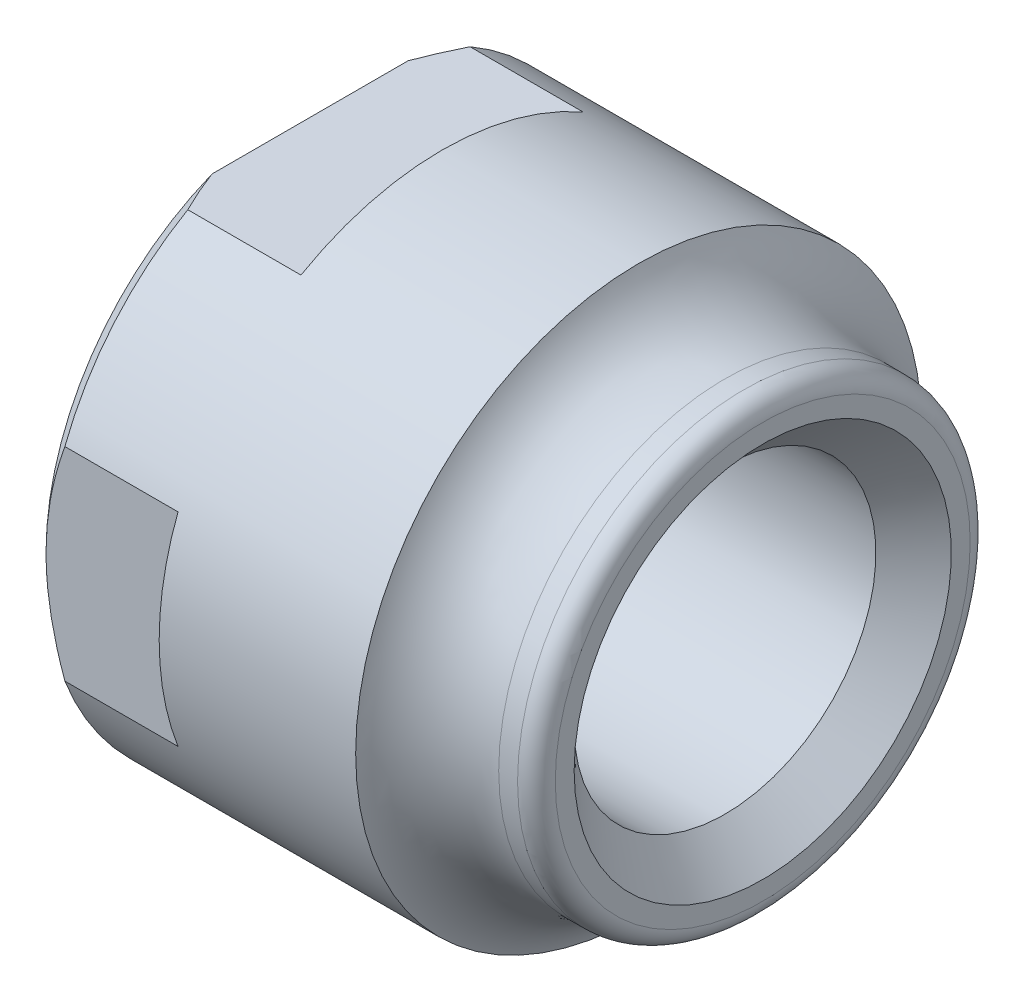
ISO-10303-21;
HEADER;
FILE_DESCRIPTION(('STEP AP214'),'2;1');
FILE_NAME('part.step','',(''),(''),'','','');
FILE_SCHEMA(('AUTOMOTIVE_DESIGN { 1 0 10303 214 1 1 1 1 }'));
ENDSEC;
DATA;
#1=APPLICATION_CONTEXT('core data for automotive mechanical design processes');
#2=APPLICATION_PROTOCOL_DEFINITION('international standard','automotive_design',2000,#1);
#3=PRODUCT_CONTEXT('',#1,'mechanical');
#4=PRODUCT('Part','Part','',(#3));
#5=PRODUCT_RELATED_PRODUCT_CATEGORY('part','',(#4));
#6=PRODUCT_DEFINITION_FORMATION('','',#4);
#7=PRODUCT_DEFINITION_CONTEXT('part definition',#1,'design');
#8=PRODUCT_DEFINITION('design','',#6,#7);
#9=PRODUCT_DEFINITION_SHAPE('','',#8);
#10=(LENGTH_UNIT() NAMED_UNIT(*) SI_UNIT(.MILLI.,.METRE.));
#11=(NAMED_UNIT(*) PLANE_ANGLE_UNIT() SI_UNIT($,.RADIAN.));
#12=(NAMED_UNIT(*) SI_UNIT($,.STERADIAN.) SOLID_ANGLE_UNIT());
#13=UNCERTAINTY_MEASURE_WITH_UNIT(LENGTH_MEASURE(1.E-05),#10,'distance_accuracy_value','');
#14=(GEOMETRIC_REPRESENTATION_CONTEXT(3) GLOBAL_UNCERTAINTY_ASSIGNED_CONTEXT((#13)) GLOBAL_UNIT_ASSIGNED_CONTEXT((#10,
#11,#12)) REPRESENTATION_CONTEXT('',''));
#15=CARTESIAN_POINT('',(0.,0.,0.));
#16=DIRECTION('',(0.,0.,1.));
#17=DIRECTION('',(1.,0.,0.));
#18=AXIS2_PLACEMENT_3D('',#15,#16,#17);
#19=CARTESIAN_POINT('',(-11.,7.50000000000003,2.22044604925031E-13));
#20=DIRECTION('',(1.,0.,0.));
#21=DIRECTION('',(0.,0.,-1.));
#22=AXIS2_PLACEMENT_3D('',#19,#20,#21);
#23=PLANE('',#22);
#24=CARTESIAN_POINT('',(-11.,0.,0.));
#25=DIRECTION('',(1.,0.,0.));
#26=DIRECTION('',(0.,0.,-1.));
#27=AXIS2_PLACEMENT_3D('',#24,#25,#26);
#28=CIRCLE('',#27,4.99999999999999);
#29=CARTESIAN_POINT('',(-11.,0.,-5.00000000000001));
#30=VERTEX_POINT('',#29);
#31=EDGE_CURVE('E144',#30,#30,#28,.T.);
#32=ORIENTED_EDGE('',*,*,#31,.T.);
#33=EDGE_LOOP('',(#32));
#34=FACE_BOUND('',#33,.T.);
#35=DIRECTION('',(0.,0.,-1.));
#36=VECTOR('',#35,1.);
#37=CARTESIAN_POINT('',(-11.,6.50000000000003,-7.00000000000001));
#38=LINE('',#37,#36);
#39=CARTESIAN_POINT('',(-11.,6.50000000000003,2.59807621135333));
#40=VERTEX_POINT('',#39);
#41=CARTESIAN_POINT('',(-11.,6.50000000000003,-2.59807621135333));
#42=VERTEX_POINT('',#41);
#43=EDGE_CURVE('E119',#40,#42,#38,.T.);
#44=ORIENTED_EDGE('',*,*,#43,.T.);
#45=CARTESIAN_POINT('',(-11.,0.,0.));
#46=DIRECTION('',(1.,0.,0.));
#47=DIRECTION('',(0.,0.,-1.));
#48=AXIS2_PLACEMENT_3D('',#45,#46,#47);
#49=CIRCLE('',#48,7.00000000000001);
#50=CARTESIAN_POINT('',(-11.,0.,-7.00000000000001));
#51=VERTEX_POINT('',#50);
#52=EDGE_CURVE('E133',#42,#51,#49,.F.);
#53=ORIENTED_EDGE('',*,*,#52,.T.);
#54=CARTESIAN_POINT('',(-11.,-6.50000000000001,-2.59807621135322));
#55=VERTEX_POINT('',#54);
#56=EDGE_CURVE('E125',#51,#55,#49,.F.);
#57=ORIENTED_EDGE('',*,*,#56,.T.);
#58=DIRECTION('',(0.,0.,1.));
#59=VECTOR('',#58,1.);
#60=CARTESIAN_POINT('',(-11.,-6.49999999999998,-6.9999999999999));
#61=LINE('',#60,#59);
#62=CARTESIAN_POINT('',(-11.,-6.49999999999998,2.59807621135344));
#63=VERTEX_POINT('',#62);
#64=EDGE_CURVE('E109',#55,#63,#61,.T.);
#65=ORIENTED_EDGE('',*,*,#64,.T.);
#66=CARTESIAN_POINT('',(-11.,0.,7.00000000000012));
#67=VERTEX_POINT('',#66);
#68=EDGE_CURVE('E134',#63,#67,#49,.F.);
#69=ORIENTED_EDGE('',*,*,#68,.T.);
#70=EDGE_CURVE('E139',#67,#40,#49,.F.);
#71=ORIENTED_EDGE('',*,*,#70,.T.);
#72=EDGE_LOOP('',(#44,#53,#57,#65,#69,#71));
#73=FACE_BOUND('',#72,.T.);
#74=ADVANCED_FACE('F27',(#34,#73),#23,.F.);
#75=CARTESIAN_POINT('',(-14.5399066753228,0.,0.));
#76=DIRECTION('',(-1.,0.,0.));
#77=DIRECTION('',(0.,0.,1.));
#78=AXIS2_PLACEMENT_3D('',#75,#76,#77);
#79=CYLINDRICAL_SURFACE('',#78,7.5);
#80=CARTESIAN_POINT('',(-2.29128784747794,0.,1.11022302462516E-13));
#81=DIRECTION('',(-1.,0.,0.));
#82=DIRECTION('',(0.,0.,1.));
#83=AXIS2_PLACEMENT_3D('',#80,#81,#82);
#84=CIRCLE('',#83,7.5);
#85=CARTESIAN_POINT('',(-2.29128784747795,0.,7.50000000000013));
#86=VERTEX_POINT('',#85);
#87=EDGE_CURVE('E165',#86,#86,#84,.T.);
#88=ORIENTED_EDGE('',*,*,#87,.T.);
#89=EDGE_LOOP('',(#88));
#90=FACE_BOUND('',#89,.T.);
#91=DIRECTION('',(-1.,0.,0.));
#92=VECTOR('',#91,1.);
#93=CARTESIAN_POINT('',(-14.5399066753228,-2.69258240356721,-6.99999999999978));
#94=LINE('',#93,#92);
#95=CARTESIAN_POINT('',(-7.50000000000001,-2.69258240356726,-6.9999999999999));
#96=VERTEX_POINT('',#95);
#97=CARTESIAN_POINT('',(-10.5,-2.69258240356721,-6.9999999999999));
#98=VERTEX_POINT('',#97);
#99=EDGE_CURVE('E42',#96,#98,#94,.T.);
#100=ORIENTED_EDGE('',*,*,#99,.F.);
#101=CARTESIAN_POINT('',(-7.5,0.,2.22044604925031E-13));
#102=DIRECTION('',(-1.,0.,0.));
#103=DIRECTION('',(0.,0.,1.));
#104=AXIS2_PLACEMENT_3D('',#101,#102,#103);
#105=CIRCLE('',#104,7.5);
#106=CARTESIAN_POINT('',(-7.50000000000002,2.69258240356732,-7.00000000000001));
#107=VERTEX_POINT('',#106);
#108=EDGE_CURVE('E12',#107,#96,#105,.T.);
#109=ORIENTED_EDGE('',*,*,#108,.F.);
#110=DIRECTION('',(-1.,0.,0.));
#111=VECTOR('',#110,1.);
#112=CARTESIAN_POINT('',(-14.5399066753228,2.69258240356735,-6.9999999999999));
#113=LINE('',#112,#111);
#114=CARTESIAN_POINT('',(-10.5,2.69258240356732,-6.9999999999999));
#115=VERTEX_POINT('',#114);
#116=EDGE_CURVE('E169',#115,#107,#113,.F.);
#117=ORIENTED_EDGE('',*,*,#116,.F.);
#118=CARTESIAN_POINT('',(-10.5,0.,0.));
#119=DIRECTION('',(1.,0.,0.));
#120=DIRECTION('',(0.,0.,-1.));
#121=AXIS2_PLACEMENT_3D('',#118,#119,#120);
#122=CIRCLE('',#121,7.5);
#123=CARTESIAN_POINT('',(-10.5,6.50000000000003,-3.7416573867739));
#124=VERTEX_POINT('',#123);
#125=EDGE_CURVE('E138',#115,#124,#122,.T.);
#126=ORIENTED_EDGE('',*,*,#125,.T.);
#127=DIRECTION('',(-1.,0.,0.));
#128=VECTOR('',#127,1.);
#129=CARTESIAN_POINT('',(-14.5399066753228,6.50000000000001,-3.7416573867739));
#130=LINE('',#129,#128);
#131=CARTESIAN_POINT('',(-7.5,6.49999999999998,-3.74165738677379));
#132=VERTEX_POINT('',#131);
#133=EDGE_CURVE('E173',#132,#124,#130,.T.);
#134=ORIENTED_EDGE('',*,*,#133,.F.);
#135=CARTESIAN_POINT('',(-7.49999999999999,6.50000000000003,3.74165738677412));
#136=VERTEX_POINT('',#135);
#137=EDGE_CURVE('E35',#136,#132,#105,.T.);
#138=ORIENTED_EDGE('',*,*,#137,.F.);
#139=DIRECTION('',(-1.,0.,0.));
#140=VECTOR('',#139,1.);
#141=CARTESIAN_POINT('',(-14.5399066753228,6.50000000000003,3.74165738677401));
#142=LINE('',#141,#140);
#143=CARTESIAN_POINT('',(-10.5,6.50000000000001,3.74165738677401));
#144=VERTEX_POINT('',#143);
#145=EDGE_CURVE('E171',#144,#136,#142,.F.);
#146=ORIENTED_EDGE('',*,*,#145,.F.);
#147=CARTESIAN_POINT('',(-10.5,2.69258240356729,7.00000000000012));
#148=VERTEX_POINT('',#147);
#149=EDGE_CURVE('E328',#144,#148,#122,.T.);
#150=ORIENTED_EDGE('',*,*,#149,.T.);
#151=DIRECTION('',(-1.,0.,0.));
#152=VECTOR('',#151,1.);
#153=CARTESIAN_POINT('',(-14.5399066753228,2.69258240356732,7.00000000000012));
#154=LINE('',#153,#152);
#155=CARTESIAN_POINT('',(-7.50000000000001,2.69258240356732,7.00000000000012));
#156=VERTEX_POINT('',#155);
#157=EDGE_CURVE('E175',#156,#148,#154,.T.);
#158=ORIENTED_EDGE('',*,*,#157,.F.);
#159=CARTESIAN_POINT('',(-7.50000000000001,-2.69258240356723,7.00000000000001));
#160=VERTEX_POINT('',#159);
#161=EDGE_CURVE('E205',#160,#156,#105,.T.);
#162=ORIENTED_EDGE('',*,*,#161,.F.);
#163=DIRECTION('',(-1.,0.,0.));
#164=VECTOR('',#163,1.);
#165=CARTESIAN_POINT('',(-14.5399066753228,-2.69258240356726,7.00000000000012));
#166=LINE('',#165,#164);
#167=CARTESIAN_POINT('',(-10.5,-2.69258240356718,7.00000000000023));
#168=VERTEX_POINT('',#167);
#169=EDGE_CURVE('E177',#168,#160,#166,.F.);
#170=ORIENTED_EDGE('',*,*,#169,.F.);
#171=CARTESIAN_POINT('',(-10.5,-6.49999999999998,3.74165738677401));
#172=VERTEX_POINT('',#171);
#173=EDGE_CURVE('E136',#168,#172,#122,.T.);
#174=ORIENTED_EDGE('',*,*,#173,.T.);
#175=DIRECTION('',(-1.,0.,0.));
#176=VECTOR('',#175,1.);
#177=CARTESIAN_POINT('',(-14.5399066753229,-6.49999999999998,3.74165738677401));
#178=LINE('',#177,#176);
#179=CARTESIAN_POINT('',(-7.5,-6.49999999999998,3.74165738677401));
#180=VERTEX_POINT('',#179);
#181=EDGE_CURVE('E50',#180,#172,#178,.T.);
#182=ORIENTED_EDGE('',*,*,#181,.F.);
#183=CARTESIAN_POINT('',(-7.50000000000001,-6.50000000000001,-3.7416573867739));
#184=VERTEX_POINT('',#183);
#185=EDGE_CURVE('E30',#184,#180,#105,.T.);
#186=ORIENTED_EDGE('',*,*,#185,.F.);
#187=DIRECTION('',(-1.,0.,0.));
#188=VECTOR('',#187,1.);
#189=CARTESIAN_POINT('',(-14.5399066753229,-6.50000000000003,-3.7416573867739));
#190=LINE('',#189,#188);
#191=CARTESIAN_POINT('',(-10.5,-6.50000000000001,-3.7416573867739));
#192=VERTEX_POINT('',#191);
#193=EDGE_CURVE('E179',#192,#184,#190,.F.);
#194=ORIENTED_EDGE('',*,*,#193,.F.);
#195=EDGE_CURVE('E127',#192,#98,#122,.T.);
#196=ORIENTED_EDGE('',*,*,#195,.T.);
#197=EDGE_LOOP('',(#100,#109,#117,#126,#134,#138,#146,#150,#158,#162,#170,#174,#182,#186,#194,#196));
#198=FACE_BOUND('',#197,.T.);
#199=ADVANCED_FACE('F225',(#90,#198),#79,.T.);
#200=CARTESIAN_POINT('',(-11.,0.,0.));
#201=DIRECTION('',(1.,0.,0.));
#202=DIRECTION('',(0.,0.,-1.));
#203=AXIS2_PLACEMENT_3D('',#200,#201,#202);
#204=CONICAL_SURFACE('',#203,7.00000000000001,0.785398163397446);
#205=ORIENTED_EDGE('',*,*,#125,.F.);
#206=CARTESIAN_POINT('',(-9.5104644485445,-4.80335444032884,-6.9999999999999));
#207=CARTESIAN_POINT('',(-9.58022515338993,-4.68004504980853,-6.9999999999999));
#208=CARTESIAN_POINT('',(-9.64861322057946,-4.55596064803132,-6.9999999999999));
#209=CARTESIAN_POINT('',(-9.78226547047349,-4.30608093200759,-6.99999999999989));
#210=CARTESIAN_POINT('',(-9.84752883188733,-4.18028517898935,-6.99999999999989));
#211=CARTESIAN_POINT('',(-10.0384838063702,-3.79924094490804,-6.9999999999999));
#212=CARTESIAN_POINT('',(-10.1588134092427,-3.54125422734984,-6.9999999999999));
#213=CARTESIAN_POINT('',(-10.3825977719299,-3.01374224965148,-6.99999999999989));
#214=CARTESIAN_POINT('',(-10.4857949771588,-2.74410650441234,-6.99999999999986));
#215=CARTESIAN_POINT('',(-10.6678390421334,-2.19700507433554,-6.99999999999993));
#216=CARTESIAN_POINT('',(-10.746725320138,-1.91955286919526,-7.00000000000004));
#217=CARTESIAN_POINT('',(-10.850441367433,-1.46457754744185,-6.99999999999999));
#218=CARTESIAN_POINT('',(-10.8844224944579,-1.28912543985645,-6.99999999999992));
#219=CARTESIAN_POINT('',(-10.9398198181762,-0.936207346127216,-6.99999999999987));
#220=CARTESIAN_POINT('',(-10.9612353977274,-0.758741261505516,-6.9999999999999));
#221=CARTESIAN_POINT('',(-10.9905551074238,-0.404096667901672,-6.9999999999999));
#222=CARTESIAN_POINT('',(-10.998564537527,-0.226926942885347,-6.99999999999987));
#223=CARTESIAN_POINT('',(-11.0010824764351,0.127509972435745,-6.99999999999992));
#224=CARTESIAN_POINT('',(-10.995590658195,0.304777164997509,-7.));
#225=CARTESIAN_POINT('',(-10.9695268399359,0.684462877124712,-7.00000000000001));
#226=CARTESIAN_POINT('',(-10.9468518626698,0.88673831168151,-6.99999999999993));
#227=CARTESIAN_POINT('',(-10.8851262310487,1.28877191693773,-6.99999999999986));
#228=CARTESIAN_POINT('',(-10.8460723373492,1.48852958163019,-6.99999999999989));
#229=CARTESIAN_POINT('',(-10.7527460172521,1.88697612508988,-6.9999999999999));
#230=CARTESIAN_POINT('',(-10.6982947566347,2.08562265617893,-6.9999999999999));
#231=CARTESIAN_POINT('',(-10.5764227790703,2.47879884943138,-6.99999999999989));
#232=CARTESIAN_POINT('',(-10.5090048887234,2.67332939859908,-6.99999999999989));
#233=CARTESIAN_POINT('',(-10.3372452106098,3.12668586830615,-6.9999999999999));
#234=CARTESIAN_POINT('',(-10.2283006193167,3.38376146297337,-6.9999999999999));
#235=CARTESIAN_POINT('',(-9.99458158904841,3.89067637520261,-6.9999999999999));
#236=CARTESIAN_POINT('',(-9.86979809852651,4.14051145390962,-6.9999999999999));
#237=CARTESIAN_POINT('',(-9.60746372366604,4.63450292809508,-6.9999999999999));
#238=CARTESIAN_POINT('',(-9.46986794296428,4.87863529464843,-6.9999999999999));
#239=CARTESIAN_POINT('',(-9.18503781364534,5.36110563570395,-6.9999999999999));
#240=CARTESIAN_POINT('',(-9.03780537601677,5.5994447462541,-6.9999999999999));
#241=CARTESIAN_POINT('',(-8.74307960122121,6.05972469805023,-6.9999999999999));
#242=CARTESIAN_POINT('',(-8.59594851191972,6.28189870394546,-6.9999999999999));
#243=CARTESIAN_POINT('',(-8.29610848968297,6.7224653956651,-6.9999999999999));
#244=CARTESIAN_POINT('',(-8.14339909620197,6.9408577670731,-6.9999999999999));
#245=CARTESIAN_POINT('',(-7.83481816974961,7.37248512718109,-6.9999999999999));
#246=CARTESIAN_POINT('',(-7.67898634048891,7.58574859999254,-6.9999999999999));
#247=CARTESIAN_POINT('',(-7.36366025352881,8.00946418977201,-6.9999999999999));
#248=CARTESIAN_POINT('',(-7.20416699623383,8.21991705039491,-6.9999999999999));
#249=CARTESIAN_POINT('',(-7.04319335098565,8.42921182222189,-6.9999999999999));
#250=B_SPLINE_CURVE_WITH_KNOTS('',3,(#206,#207,#208,#209,#210,#211,#212,#213,#214,#215,#216,
#217,#218,#219,#220,#221,#222,#223,#224,#225,#226,#227,#228,#229,#230,#231,#232,#233,#234,#235,
#236,#237,#238,#239,#240,#241,#242,#243,#244,#245,#246,#247,#248,#249),.UNSPECIFIED.,.F.,.F.,(4,
2,2,2,2,2,2,2,2,2,2,2,2,2,2,2,2,2,2,2,2,4),(0.,0.425007431194064,0.850125963945295,
1.70353641051276,2.56879851513163,3.43265019278093,3.96839432261139,4.50416476268646,
5.0357068438784,5.5672618009072,6.177147341071,6.78715355843523,7.404558282959,8.02182857144387,
8.85872603239434,9.69610393157133,10.5365352800348,11.3768004695187,12.1761244720147,
12.9755146166519,13.7678631511011,14.5599977115599),.UNSPECIFIED.);
#251=EDGE_CURVE('E202',#115,#51,#250,.F.);
#252=ORIENTED_EDGE('',*,*,#251,.T.);
#253=ORIENTED_EDGE('',*,*,#52,.F.);
#254=CARTESIAN_POINT('',(-2.09444456432686,6.50000000000003,14.5167728410026));
#255=CARTESIAN_POINT('',(-2.28888590049727,6.50000000000003,14.3037257352321));
#256=CARTESIAN_POINT('',(-2.4829416560533,6.50000000000003,14.0903267767934));
#257=CARTESIAN_POINT('',(-2.87016852338466,6.50000000000003,13.662724509046));
#258=CARTESIAN_POINT('',(-3.06333962746361,6.50000000000003,13.4485211927689));
#259=CARTESIAN_POINT('',(-3.6414456056037,6.50000000000003,12.8044535363723));
#260=CARTESIAN_POINT('',(-4.02487723192493,6.50000000000003,12.3732363582102));
#261=CARTESIAN_POINT('',(-4.78920557614493,6.50000000000003,11.5029881454459));
#262=CARTESIAN_POINT('',(-5.17006366086683,6.50000000000003,11.0639231068428));
#263=CARTESIAN_POINT('',(-5.92439287672877,6.50000000000003,10.1795722564133));
#264=CARTESIAN_POINT('',(-6.29786498617129,6.50000000000003,9.73428728195598));
#265=CARTESIAN_POINT('',(-6.97881092586992,6.50000000000003,8.90306628730305));
#266=CARTESIAN_POINT('',(-7.28773358351573,6.50000000000003,8.51832372562222));
#267=CARTESIAN_POINT('',(-7.74331145203938,6.50000000000003,7.93500490400866));
#268=CARTESIAN_POINT('',(-7.89389490284897,6.50000000000003,7.73949703673706));
#269=CARTESIAN_POINT('',(-8.19191036379332,6.50000000000003,7.34609714701157));
#270=CARTESIAN_POINT('',(-8.33934246050561,6.50000000000003,7.14820519029021));
#271=CARTESIAN_POINT('',(-8.63021281144892,6.50000000000003,6.74991794145694));
#272=CARTESIAN_POINT('',(-8.77365627312661,6.50000000000003,6.54952646102954));
#273=CARTESIAN_POINT('',(-9.05592097883785,6.50000000000003,6.14552229203602));
#274=CARTESIAN_POINT('',(-9.19474250100636,6.50000000000003,5.94190979839287));
#275=CARTESIAN_POINT('',(-9.46663604426284,6.50000000000003,5.53100587062468));
#276=CARTESIAN_POINT('',(-9.59971075746195,6.50000000000003,5.3237162247117));
#277=CARTESIAN_POINT('',(-9.85876830842536,6.50000000000003,4.90476923575897));
#278=CARTESIAN_POINT('',(-9.98475214542431,6.50000000000003,4.69311251389402));
#279=CARTESIAN_POINT('',(-10.2246432273407,6.50000000000003,4.27032520172268));
#280=CARTESIAN_POINT('',(-10.3387802170412,6.50000000000003,4.05932576652228));
#281=CARTESIAN_POINT('',(-10.5564451002365,6.50000000000003,3.63185218077574));
#282=CARTESIAN_POINT('',(-10.6599720014352,6.50000000000003,3.41537752052183));
#283=CARTESIAN_POINT('',(-10.8534861395401,6.50000000000004,2.97679700349965));
#284=CARTESIAN_POINT('',(-10.9434939642464,6.50000000000005,2.75470032370624));
#285=CARTESIAN_POINT('',(-11.1067900658467,6.50000000000002,2.30440786641476));
#286=CARTESIAN_POINT('',(-11.1800830172556,6.49999999999997,2.07621381411307));
#287=CARTESIAN_POINT('',(-11.2941903524043,6.49999999999998,1.65836655300459));
#288=CARTESIAN_POINT('',(-11.3385349200322,6.50000000000002,1.4696830764343));
#289=CARTESIAN_POINT('',(-11.4119868912289,6.50000000000005,1.08935429814918));
#290=CARTESIAN_POINT('',(-11.4410964663115,6.50000000000003,0.897709422547403));
#291=CARTESIAN_POINT('',(-11.4825837296564,6.50000000000003,0.513013752311657));
#292=CARTESIAN_POINT('',(-11.4949977529203,6.50000000000005,0.319966933061174));
#293=CARTESIAN_POINT('',(-11.5025309231229,6.50000000000002,-0.0664703249129604));
#294=CARTESIAN_POINT('',(-11.4976500313757,6.49999999999998,-0.259860764404268));
#295=CARTESIAN_POINT('',(-11.470889972009,6.49999999999998,-0.645097634224882));
#296=CARTESIAN_POINT('',(-11.4490410008602,6.50000000000002,-0.836946196330901));
#297=CARTESIAN_POINT('',(-11.3895216676062,6.50000000000005,-1.21815298294827));
#298=CARTESIAN_POINT('',(-11.3518499680599,6.50000000000004,-1.40751099554627));
#299=CARTESIAN_POINT('',(-11.2622785911483,6.50000000000003,-1.7833438476787));
#300=CARTESIAN_POINT('',(-11.210339788573,6.50000000000003,-1.96980924712377));
#301=CARTESIAN_POINT('',(-11.0942424687091,6.50000000000003,-2.3388410236065));
#302=CARTESIAN_POINT('',(-11.0300844407203,6.50000000000003,-2.52140755644276));
#303=CARTESIAN_POINT('',(-10.8690261617707,6.50000000000003,-2.9410108382494));
#304=CARTESIAN_POINT('',(-10.7682493912508,6.50000000000003,-3.17655321772081));
#305=CARTESIAN_POINT('',(-10.5525004168119,6.50000000000003,-3.64109932787145));
#306=CARTESIAN_POINT('',(-10.4375205941356,6.50000000000003,-3.87009946738187));
#307=CARTESIAN_POINT('',(-10.1962610693955,6.50000000000003,-4.32262084311943));
#308=CARTESIAN_POINT('',(-10.0699588542962,6.50000000000003,-4.54612998502487));
#309=CARTESIAN_POINT('',(-9.80867897099008,6.50000000000003,-4.98793097432684));
#310=CARTESIAN_POINT('',(-9.67370280738511,6.50000000000003,-5.20622371760723));
#311=CARTESIAN_POINT('',(-9.39535784528376,6.50000000000003,-5.64074407396269));
#312=CARTESIAN_POINT('',(-9.25191342549017,6.50000000000003,-5.85692301835826));
#313=CARTESIAN_POINT('',(-8.95940893705072,6.50000000000003,-6.28544298212879));
#314=CARTESIAN_POINT('',(-8.81034868769783,6.50000000000003,-6.49778387767654));
#315=CARTESIAN_POINT('',(-8.50787358663583,6.50000000000004,-6.91895264945622));
#316=CARTESIAN_POINT('',(-8.35446407450141,6.50000000000004,-7.12778437128633));
#317=CARTESIAN_POINT('',(-8.04394168422079,6.50000000000003,-7.54267904332927));
#318=CARTESIAN_POINT('',(-7.88682869336657,6.50000000000001,-7.74874190897707));
#319=CARTESIAN_POINT('',(-7.5036804823029,6.5,-8.24357014373984));
#320=CARTESIAN_POINT('',(-7.27611434653797,6.50000000000002,-8.53114916312642));
#321=CARTESIAN_POINT('',(-6.81623637378956,6.50000000000004,-9.10248622387731));
#322=CARTESIAN_POINT('',(-6.58392441249762,6.50000000000004,-9.38624416483142));
#323=CARTESIAN_POINT('',(-6.11542687449583,6.50000000000003,-9.95077293822639));
#324=CARTESIAN_POINT('',(-5.87923946257725,6.50000000000003,-10.2315422451968));
#325=CARTESIAN_POINT('',(-5.40383478536215,6.50000000000003,-10.7905037692497));
#326=CARTESIAN_POINT('',(-5.16461749590008,6.50000000000003,-11.0686959657472));
#327=CARTESIAN_POINT('',(-4.69194593627728,6.50000000000003,-11.6134401445373));
#328=CARTESIAN_POINT('',(-4.45857492231151,6.50000000000003,-11.8800644514341));
#329=CARTESIAN_POINT('',(-3.98991092076485,6.50000000000003,-12.4116199763626));
#330=CARTESIAN_POINT('',(-3.75461792189077,6.50000000000003,-12.6765511844296));
#331=CARTESIAN_POINT('',(-3.28262473724137,6.50000000000003,-13.2047415335476));
#332=CARTESIAN_POINT('',(-3.04592595363371,6.50000000000003,-13.4680019286517));
#333=CARTESIAN_POINT('',(-2.57115677585715,6.50000000000003,-13.9932737495572));
#334=CARTESIAN_POINT('',(-2.33308640935326,6.50000000000003,-14.2552852003565));
#335=CARTESIAN_POINT('',(-2.09444456432689,6.50000000000003,-14.5167728410026));
#336=B_SPLINE_CURVE_WITH_KNOTS('',3,(#254,#255,#256,#257,#258,#259,#260,#261,#262,#263,#264,
#265,#266,#267,#268,#269,#270,#271,#272,#273,#274,#275,#276,#277,#278,#279,#280,#281,#282,#283,
#284,#285,#286,#287,#288,#289,#290,#291,#292,#293,#294,#295,#296,#297,#298,#299,#300,#301,#302,
#303,#304,#305,#306,#307,#308,#309,#310,#311,#312,#313,#314,#315,#316,#317,#318,#319,#320,#321,
#322,#323,#324,#325,#326,#327,#328,#329,#330,#331,#332,#333,#334,#335),.UNSPECIFIED.,.F.,.F.,(4,
2,2,2,2,2,2,2,2,2,2,2,2,2,2,2,2,2,2,2,2,2,2,2,2,2,2,2,2,2,2,2,2,2,2,2,2,2,2,2,4),(0.,
0.86531322140501,1.73063395669946,3.46170176172355,5.20534138745016,6.9487484929174,
8.42884989750244,9.16915482780826,9.90943939342089,10.6487071709608,11.3879303807947,
12.1268034570576,12.8655721504997,13.5850095874066,14.3045142475676,15.0229118369983,
15.7411082708739,16.3220364036134,16.9028817114216,17.4824608524156,18.0620412898361,
18.6405926602068,19.2191929433914,19.7993960633781,20.3795759549178,21.1475304702325,
21.9158987329388,22.6858301950708,23.4556284618599,24.2338427048727,25.0120820108056,
25.7894040539476,26.566749783959,27.6668585824249,28.7669962333275,29.8676708141783,
30.9683541792715,32.0313367795752,33.0943256302527,34.1563897849169,35.2184325920844),.UNSPECIFIED.);
#337=EDGE_CURVE('E200',#42,#124,#336,.T.);
#338=ORIENTED_EDGE('',*,*,#337,.T.);
#339=EDGE_LOOP('',(#205,#252,#253,#338));
#340=FACE_BOUND('',#339,.T.);
#341=ADVANCED_FACE('F199',(#340),#204,.T.);
#342=ORIENTED_EDGE('',*,*,#56,.F.);
#343=EDGE_CURVE('E204',#51,#98,#250,.F.);
#344=ORIENTED_EDGE('',*,*,#343,.T.);
#345=ORIENTED_EDGE('',*,*,#195,.F.);
#346=CARTESIAN_POINT('',(-2.09444456432689,-6.50000000000001,-14.5167728410025));
#347=CARTESIAN_POINT('',(-2.28888590049732,-6.50000000000002,-14.303725735232));
#348=CARTESIAN_POINT('',(-2.48294165605336,-6.50000000000003,-14.0903267767933));
#349=CARTESIAN_POINT('',(-2.87016852338472,-6.50000000000004,-13.6627245090459));
#350=CARTESIAN_POINT('',(-3.06333962746367,-6.50000000000004,-13.4485211927688));
#351=CARTESIAN_POINT('',(-3.64144560560375,-6.50000000000003,-12.8044535363722));
#352=CARTESIAN_POINT('',(-4.02487723192498,-6.50000000000003,-12.3732363582101));
#353=CARTESIAN_POINT('',(-4.789205576145,-6.50000000000004,-11.5029881454458));
#354=CARTESIAN_POINT('',(-5.17006366086692,-6.50000000000005,-11.0639231068427));
#355=CARTESIAN_POINT('',(-5.92439287672882,-6.50000000000002,-10.1795722564131));
#356=CARTESIAN_POINT('',(-6.29786498617127,-6.49999999999997,-9.73428728195575));
#357=CARTESIAN_POINT('',(-6.97881092586991,-6.49999999999998,-8.90306628730284));
#358=CARTESIAN_POINT('',(-7.28773358351579,-6.50000000000002,-8.51832372562208));
#359=CARTESIAN_POINT('',(-7.74331145203944,-6.50000000000004,-7.93500490400855));
#360=CARTESIAN_POINT('',(-7.89389490284902,-6.50000000000003,-7.73949703673695));
#361=CARTESIAN_POINT('',(-8.19191036379336,-6.50000000000003,-7.34609714701146));
#362=CARTESIAN_POINT('',(-8.33934246050565,-6.50000000000003,-7.14820519029011));
#363=CARTESIAN_POINT('',(-8.63021281144895,-6.50000000000003,-6.74991794145685));
#364=CARTESIAN_POINT('',(-8.77365627312664,-6.50000000000003,-6.54952646102945));
#365=CARTESIAN_POINT('',(-9.05592097883786,-6.50000000000003,-6.14552229203594));
#366=CARTESIAN_POINT('',(-9.19474250100638,-6.50000000000003,-5.9419097983928));
#367=CARTESIAN_POINT('',(-9.46663604426283,-6.50000000000004,-5.53100587062461));
#368=CARTESIAN_POINT('',(-9.59971075746193,-6.50000000000004,-5.32371622471164));
#369=CARTESIAN_POINT('',(-9.85876830842536,-6.50000000000003,-4.90476923575893));
#370=CARTESIAN_POINT('',(-9.98475214542434,-6.50000000000001,-4.69311251389401));
#371=CARTESIAN_POINT('',(-10.2246432273407,-6.50000000000001,-4.27032520172265));
#372=CARTESIAN_POINT('',(-10.3387802170412,-6.50000000000003,-4.05932576652222));
#373=CARTESIAN_POINT('',(-10.5564451002365,-6.50000000000004,-3.63185218077562));
#374=CARTESIAN_POINT('',(-10.6599720014352,-6.50000000000004,-3.41537752052169));
#375=CARTESIAN_POINT('',(-10.8534861395402,-6.50000000000003,-2.97679700349946));
#376=CARTESIAN_POINT('',(-10.9434939642465,-6.50000000000003,-2.75470032370603));
#377=CARTESIAN_POINT('',(-11.1067900658467,-6.50000000000003,-2.30440786641449));
#378=CARTESIAN_POINT('',(-11.1800830172556,-6.50000000000003,-2.07621381411276));
#379=CARTESIAN_POINT('',(-11.2941903524043,-6.50000000000003,-1.65836655300428));
#380=CARTESIAN_POINT('',(-11.3385349200322,-6.50000000000003,-1.46968307643403));
#381=CARTESIAN_POINT('',(-11.4119868912289,-6.50000000000003,-1.08935429814896));
#382=CARTESIAN_POINT('',(-11.4410964663114,-6.50000000000003,-0.897709422547204));
#383=CARTESIAN_POINT('',(-11.4825837296563,-6.50000000000004,-0.513013752311511));
#384=CARTESIAN_POINT('',(-11.4949977529202,-6.50000000000005,-0.319966933061057));
#385=CARTESIAN_POINT('',(-11.5025309231229,-6.50000000000002,0.0664703249130207));
#386=CARTESIAN_POINT('',(-11.4976500313757,-6.49999999999998,0.2598607644043));
#387=CARTESIAN_POINT('',(-11.470889972009,-6.49999999999998,0.645097634224905));
#388=CARTESIAN_POINT('',(-11.4490410008601,-6.50000000000002,0.836946196330943));
#389=CARTESIAN_POINT('',(-11.3895216676061,-6.50000000000005,1.21815298294836));
#390=CARTESIAN_POINT('',(-11.3518499680598,-6.50000000000003,1.40751099554639));
#391=CARTESIAN_POINT('',(-11.2622785911482,-6.50000000000003,1.78334384767886));
#392=CARTESIAN_POINT('',(-11.2103397885729,-6.50000000000005,1.96980924712395));
#393=CARTESIAN_POINT('',(-11.094242468709,-6.50000000000002,2.33884102360675));
#394=CARTESIAN_POINT('',(-11.0300844407203,-6.49999999999998,2.52140755644306));
#395=CARTESIAN_POINT('',(-10.8690261617707,-6.49999999999997,2.94101083824972));
#396=CARTESIAN_POINT('',(-10.7682493912507,-6.50000000000002,3.17655321772106));
#397=CARTESIAN_POINT('',(-10.5525004168117,-6.50000000000005,3.64109932787163));
#398=CARTESIAN_POINT('',(-10.4375205941355,-6.50000000000004,3.87009946738205));
#399=CARTESIAN_POINT('',(-10.1962610693954,-6.50000000000003,4.32262084311961));
#400=CARTESIAN_POINT('',(-10.069958854296,-6.50000000000003,4.54612998502504));
#401=CARTESIAN_POINT('',(-9.80867897098994,-6.50000000000004,4.98793097432699));
#402=CARTESIAN_POINT('',(-9.67370280738497,-6.50000000000003,5.20622371760738));
#403=CARTESIAN_POINT('',(-9.39535784528363,-6.50000000000003,5.64074407396283));
#404=CARTESIAN_POINT('',(-9.25191342549004,-6.50000000000004,5.85692301835839));
#405=CARTESIAN_POINT('',(-8.95940893705059,-6.50000000000003,6.28544298212891));
#406=CARTESIAN_POINT('',(-8.81034868769772,-6.50000000000003,6.49778387767666));
#407=CARTESIAN_POINT('',(-8.50787358663572,-6.50000000000004,6.91895264945631));
#408=CARTESIAN_POINT('',(-8.35446407450129,-6.50000000000005,7.1277843712864));
#409=CARTESIAN_POINT('',(-8.04394168422071,-6.50000000000002,7.54267904332935));
#410=CARTESIAN_POINT('',(-7.88682869336655,-6.49999999999998,7.74874190897718));
#411=CARTESIAN_POINT('',(-7.50368048230291,-6.49999999999997,8.24357014373996));
#412=CARTESIAN_POINT('',(-7.27611434653791,-6.50000000000002,8.53114916312649));
#413=CARTESIAN_POINT('',(-6.81623637378946,-6.50000000000005,9.10248622387735));
#414=CARTESIAN_POINT('',(-6.58392441249754,-6.50000000000004,9.38624416483147));
#415=CARTESIAN_POINT('',(-6.11542687449575,-6.50000000000003,9.95077293822646));
#416=CARTESIAN_POINT('',(-5.87923946257717,-6.50000000000003,10.2315422451969));
#417=CARTESIAN_POINT('',(-5.40383478536207,-6.50000000000004,10.7905037692498));
#418=CARTESIAN_POINT('',(-5.16461749589999,-6.50000000000003,11.0686959657472));
#419=CARTESIAN_POINT('',(-4.69194593627719,-6.50000000000003,11.6134401445374));
#420=CARTESIAN_POINT('',(-4.45857492231142,-6.50000000000003,11.8800644514342));
#421=CARTESIAN_POINT('',(-3.98991092076476,-6.50000000000003,12.4116199763627));
#422=CARTESIAN_POINT('',(-3.75461792189068,-6.50000000000003,12.6765511844297));
#423=CARTESIAN_POINT('',(-3.28262473724128,-6.50000000000004,13.2047415335477));
#424=CARTESIAN_POINT('',(-3.04592595363362,-6.50000000000004,13.4680019286518));
#425=CARTESIAN_POINT('',(-2.57115677585707,-6.50000000000003,13.9932737495573));
#426=CARTESIAN_POINT('',(-2.3330864093532,-6.50000000000002,14.2552852003566));
#427=CARTESIAN_POINT('',(-2.09444456432686,-6.50000000000001,14.5167728410027));
#428=B_SPLINE_CURVE_WITH_KNOTS('',3,(#346,#347,#348,#349,#350,#351,#352,#353,#354,#355,#356,
#357,#358,#359,#360,#361,#362,#363,#364,#365,#366,#367,#368,#369,#370,#371,#372,#373,#374,#375,
#376,#377,#378,#379,#380,#381,#382,#383,#384,#385,#386,#387,#388,#389,#390,#391,#392,#393,#394,
#395,#396,#397,#398,#399,#400,#401,#402,#403,#404,#405,#406,#407,#408,#409,#410,#411,#412,#413,
#414,#415,#416,#417,#418,#419,#420,#421,#422,#423,#424,#425,#426,#427),.UNSPECIFIED.,.F.,.F.,(4,
2,2,2,2,2,2,2,2,2,2,2,2,2,2,2,2,2,2,2,2,2,2,2,2,2,2,2,2,2,2,2,2,2,2,2,2,2,2,2,4),(0.,
0.86531322140501,1.73063395669946,3.46170176172356,5.20534138745019,6.94874849291746,
8.42884989750246,9.16915482780827,9.90943939342088,10.6487071709608,11.3879303807946,
12.1268034570575,12.8655721504996,13.5850095874066,14.3045142475676,15.0229118369984,
15.7411082708741,16.3220364036136,16.9028817114216,17.4824608524155,18.062041289836,
18.6405926602068,19.2191929433914,19.7993960633782,20.379575954918,21.1475304702326,
21.9158987329388,22.6858301950708,23.4556284618599,24.2338427048728,25.0120820108056,
25.7894040539475,26.566749783959,27.6668585824248,28.7669962333274,29.8676708141782,
30.9683541792715,32.0313367795751,33.0943256302526,34.1563897849169,35.2184325920843),.UNSPECIFIED.);
#429=EDGE_CURVE('E112',#192,#55,#428,.T.);
#430=ORIENTED_EDGE('',*,*,#429,.T.);
#431=EDGE_LOOP('',(#342,#344,#345,#430));
#432=FACE_BOUND('',#431,.T.);
#433=ADVANCED_FACE('F124',(#432),#204,.T.);
#434=ORIENTED_EDGE('',*,*,#149,.F.);
#435=EDGE_CURVE('E206',#144,#40,#336,.T.);
#436=ORIENTED_EDGE('',*,*,#435,.T.);
#437=ORIENTED_EDGE('',*,*,#70,.F.);
#438=CARTESIAN_POINT('',(-9.51046444854452,-4.80335444032884,7.00000000000012));
#439=CARTESIAN_POINT('',(-9.58022515338989,-4.6800450498085,7.00000000000005));
#440=CARTESIAN_POINT('',(-9.64861322057939,-4.55596064803129,7.00000000000002));
#441=CARTESIAN_POINT('',(-9.7822654704734,-4.30608093200755,6.99999999999999));
#442=CARTESIAN_POINT('',(-9.84752883188724,-4.18028517898932,7.));
#443=CARTESIAN_POINT('',(-10.0384838063701,-3.79924094490801,7.00000000000002));
#444=CARTESIAN_POINT('',(-10.1588134092426,-3.54125422734979,7.00000000000002));
#445=CARTESIAN_POINT('',(-10.3825977719298,-3.01374224965142,6.99999999999999));
#446=CARTESIAN_POINT('',(-10.4857949771587,-2.74410650441227,6.99999999999997));
#447=CARTESIAN_POINT('',(-10.6678390421333,-2.19700507433549,7.00000000000004));
#448=CARTESIAN_POINT('',(-10.746725320138,-1.91955286919523,7.00000000000015));
#449=CARTESIAN_POINT('',(-10.850441367433,-1.46457754744182,7.0000000000001));
#450=CARTESIAN_POINT('',(-10.8844224944578,-1.28912543985642,7.00000000000003));
#451=CARTESIAN_POINT('',(-10.9398198181761,-0.936207346127183,6.99999999999998));
#452=CARTESIAN_POINT('',(-10.9612353977273,-0.758741261505489,7.00000000000001));
#453=CARTESIAN_POINT('',(-10.9905551074237,-0.404096667901653,7.00000000000001));
#454=CARTESIAN_POINT('',(-10.9985645375268,-0.22692694288533,6.99999999999998));
#455=CARTESIAN_POINT('',(-11.001082476435,0.127509972435756,7.00000000000003));
#456=CARTESIAN_POINT('',(-10.995590658195,0.304777164997517,7.00000000000011));
#457=CARTESIAN_POINT('',(-10.9695268399359,0.684462877124706,7.00000000000012));
#458=CARTESIAN_POINT('',(-10.9468518626697,0.886738311681491,7.00000000000004));
#459=CARTESIAN_POINT('',(-10.8851262310486,1.28877191693771,6.99999999999998));
#460=CARTESIAN_POINT('',(-10.8460723373491,1.48852958163016,7.));
#461=CARTESIAN_POINT('',(-10.752746017252,1.88697612508985,7.00000000000001));
#462=CARTESIAN_POINT('',(-10.6982947566346,2.0856226561789,6.99999999999998));
#463=CARTESIAN_POINT('',(-10.5764227790702,2.47879884943136,7.00000000000003));
#464=CARTESIAN_POINT('',(-10.5090048887234,2.67332939859908,7.0000000000001));
#465=CARTESIAN_POINT('',(-10.3372452106098,3.12668586830615,7.00000000000014));
#466=CARTESIAN_POINT('',(-10.2283006193167,3.38376146297333,7.00000000000004));
#467=CARTESIAN_POINT('',(-9.99458158904831,3.89067637520254,6.99999999999997));
#468=CARTESIAN_POINT('',(-9.86979809852644,4.14051145390956,7.));
#469=CARTESIAN_POINT('',(-9.60746372366599,4.63450292809503,7.00000000000002));
#470=CARTESIAN_POINT('',(-9.46986794296422,4.87863529464839,7.00000000000001));
#471=CARTESIAN_POINT('',(-9.18503781364527,5.36110563570391,7.));
#472=CARTESIAN_POINT('',(-9.03780537601671,5.59944474625406,7.00000000000001));
#473=CARTESIAN_POINT('',(-8.74307960122114,6.0597246980502,7.00000000000001));
#474=CARTESIAN_POINT('',(-8.59594851191965,6.28189870394544,7.00000000000001));
#475=CARTESIAN_POINT('',(-8.2961084896829,6.72246539566509,7.00000000000001));
#476=CARTESIAN_POINT('',(-8.1433990962019,6.94085776707309,7.00000000000001));
#477=CARTESIAN_POINT('',(-7.83481816974954,7.37248512718108,7.));
#478=CARTESIAN_POINT('',(-7.67898634048883,7.58574859999253,7.));
#479=CARTESIAN_POINT('',(-7.36366025352874,8.009464189772,7.00000000000002));
#480=CARTESIAN_POINT('',(-7.20416699623378,8.21991705039491,7.00000000000005));
#481=CARTESIAN_POINT('',(-7.04319335098565,8.42921182222192,7.00000000000012));
#482=B_SPLINE_CURVE_WITH_KNOTS('',3,(#438,#439,#440,#441,#442,#443,#444,#445,#446,#447,#448,
#449,#450,#451,#452,#453,#454,#455,#456,#457,#458,#459,#460,#461,#462,#463,#464,#465,#466,#467,
#468,#469,#470,#471,#472,#473,#474,#475,#476,#477,#478,#479,#480,#481),.UNSPECIFIED.,.F.,.F.,(4,
2,2,2,2,2,2,2,2,2,2,2,2,2,2,2,2,2,2,2,2,4),(0.,0.425007431194053,0.850125963945279,
1.70353641051276,2.56879851513164,3.43265019278093,3.96839432261137,4.50416476268643,
5.03570684387837,5.56726180090715,6.17714734107094,6.78715355843516,7.40455828295893,
8.02182857144379,8.85872603239424,9.69610393157122,10.5365352800348,11.3768004695187,
12.1761244720146,12.9755146166519,13.767863151101,14.5599977115598),.UNSPECIFIED.);
#483=EDGE_CURVE('E128',#67,#148,#482,.T.);
#484=ORIENTED_EDGE('',*,*,#483,.T.);
#485=EDGE_LOOP('',(#434,#436,#437,#484));
#486=FACE_BOUND('',#485,.T.);
#487=ADVANCED_FACE('F286',(#486),#204,.T.);
#488=ORIENTED_EDGE('',*,*,#173,.F.);
#489=EDGE_CURVE('E241',#168,#67,#482,.T.);
#490=ORIENTED_EDGE('',*,*,#489,.T.);
#491=ORIENTED_EDGE('',*,*,#68,.F.);
#492=EDGE_CURVE('E114',#63,#172,#428,.T.);
#493=ORIENTED_EDGE('',*,*,#492,.T.);
#494=EDGE_LOOP('',(#488,#490,#491,#493));
#495=FACE_BOUND('',#494,.T.);
#496=ADVANCED_FACE('F226',(#495),#204,.T.);
#497=CARTESIAN_POINT('',(-14.5399066753228,0.,0.));
#498=DIRECTION('',(-1.,0.,0.));
#499=DIRECTION('',(0.,0.,1.));
#500=AXIS2_PLACEMENT_3D('',#497,#498,#499);
#501=CYLINDRICAL_SURFACE('',#500,4.);
#502=CARTESIAN_POINT('',(-10.,0.,0.));
#503=DIRECTION('',(1.,0.,0.));
#504=DIRECTION('',(0.,0.,-1.));
#505=AXIS2_PLACEMENT_3D('',#502,#503,#504);
#506=CIRCLE('',#505,4.);
#507=CARTESIAN_POINT('',(-10.,0.,-4.00000000000001));
#508=VERTEX_POINT('',#507);
#509=EDGE_CURVE('E148',#508,#508,#506,.F.);
#510=ORIENTED_EDGE('',*,*,#509,.T.);
#511=EDGE_LOOP('',(#510));
#512=FACE_BOUND('',#511,.T.);
#513=CARTESIAN_POINT('',(0.,0.,0.));
#514=DIRECTION('',(-1.,0.,0.));
#515=DIRECTION('',(0.,0.,1.));
#516=AXIS2_PLACEMENT_3D('',#513,#514,#515);
#517=CIRCLE('',#516,4.);
#518=CARTESIAN_POINT('',(0.,0.,4.00000000000001));
#519=VERTEX_POINT('',#518);
#520=EDGE_CURVE('E153',#519,#519,#517,.F.);
#521=ORIENTED_EDGE('',*,*,#520,.T.);
#522=EDGE_LOOP('',(#521));
#523=FACE_BOUND('',#522,.T.);
#524=ADVANCED_FACE('F274',(#512,#523),#501,.F.);
#525=CARTESIAN_POINT('',(0.999999999999994,6.00000000000003,0.));
#526=DIRECTION('',(-1.,0.,0.));
#527=DIRECTION('',(0.,0.,1.));
#528=AXIS2_PLACEMENT_3D('',#525,#526,#527);
#529=PLANE('',#528);
#530=CARTESIAN_POINT('',(0.999999999999987,0.,0.));
#531=DIRECTION('',(-1.,0.,0.));
#532=DIRECTION('',(0.,0.,1.));
#533=AXIS2_PLACEMENT_3D('',#530,#531,#532);
#534=CIRCLE('',#533,5.);
#535=CARTESIAN_POINT('',(0.999999999999987,0.,5.00000000000001));
#536=VERTEX_POINT('',#535);
#537=EDGE_CURVE('E141',#536,#536,#534,.T.);
#538=ORIENTED_EDGE('',*,*,#537,.T.);
#539=EDGE_LOOP('',(#538));
#540=FACE_BOUND('',#539,.T.);
#541=CARTESIAN_POINT('',(0.999999999999987,0.,0.));
#542=DIRECTION('',(-1.,0.,0.));
#543=DIRECTION('',(0.,0.,1.));
#544=AXIS2_PLACEMENT_3D('',#541,#542,#543);
#545=CIRCLE('',#544,5.5);
#546=CARTESIAN_POINT('',(0.999999999999987,0.,5.50000000000001));
#547=VERTEX_POINT('',#546);
#548=EDGE_CURVE('E156',#547,#547,#545,.F.);
#549=ORIENTED_EDGE('',*,*,#548,.T.);
#550=EDGE_LOOP('',(#549));
#551=FACE_BOUND('',#550,.T.);
#552=ADVANCED_FACE('F277',(#540,#551),#529,.F.);
#553=CARTESIAN_POINT('',(-14.5399066753228,0.,0.));
#554=DIRECTION('',(-1.,0.,0.));
#555=DIRECTION('',(0.,0.,1.));
#556=AXIS2_PLACEMENT_3D('',#553,#554,#555);
#557=CYLINDRICAL_SURFACE('',#556,6.);
#558=CARTESIAN_POINT('',(0.499999999999987,0.,0.));
#559=DIRECTION('',(-1.,0.,0.));
#560=DIRECTION('',(0.,0.,1.));
#561=AXIS2_PLACEMENT_3D('',#558,#559,#560);
#562=CIRCLE('',#561,6.);
#563=CARTESIAN_POINT('',(0.499999999999986,0.,6.00000000000001));
#564=VERTEX_POINT('',#563);
#565=EDGE_CURVE('E159',#564,#564,#562,.T.);
#566=ORIENTED_EDGE('',*,*,#565,.T.);
#567=EDGE_LOOP('',(#566));
#568=FACE_BOUND('',#567,.T.);
#569=CARTESIAN_POINT('',(0.,0.,0.));
#570=DIRECTION('',(-1.,0.,0.));
#571=DIRECTION('',(0.,0.,1.));
#572=AXIS2_PLACEMENT_3D('',#569,#570,#571);
#573=CIRCLE('',#572,6.);
#574=CARTESIAN_POINT('',(0.,0.,6.00000000000001));
#575=VERTEX_POINT('',#574);
#576=EDGE_CURVE('E162',#575,#575,#573,.T.);
#577=ORIENTED_EDGE('',*,*,#576,.F.);
#578=EDGE_LOOP('',(#577));
#579=FACE_BOUND('',#578,.T.);
#580=ADVANCED_FACE('F283',(#568,#579),#557,.T.);
#581=CARTESIAN_POINT('',(0.,0.,0.));
#582=DIRECTION('',(-1.,0.,0.));
#583=DIRECTION('',(0.,0.,1.));
#584=AXIS2_PLACEMENT_3D('',#581,#582,#583);
#585=TOROIDAL_SURFACE('',#584,8.5,2.5);
#586=ORIENTED_EDGE('',*,*,#87,.F.);
#587=EDGE_LOOP('',(#586));
#588=FACE_BOUND('',#587,.T.);
#589=ORIENTED_EDGE('',*,*,#576,.T.);
#590=EDGE_LOOP('',(#589));
#591=FACE_BOUND('',#590,.T.);
#592=ADVANCED_FACE('F291',(#588,#591),#585,.F.);
#593=CARTESIAN_POINT('',(0.499999999999987,0.,0.));
#594=DIRECTION('',(-1.,0.,0.));
#595=DIRECTION('',(0.,0.,1.));
#596=AXIS2_PLACEMENT_3D('',#593,#594,#595);
#597=TOROIDAL_SURFACE('',#596,5.5,0.5);
#598=ORIENTED_EDGE('',*,*,#548,.F.);
#599=EDGE_LOOP('',(#598));
#600=FACE_BOUND('',#599,.T.);
#601=ORIENTED_EDGE('',*,*,#565,.F.);
#602=EDGE_LOOP('',(#601));
#603=FACE_BOUND('',#602,.T.);
#604=ADVANCED_FACE('F271',(#600,#603),#597,.T.);
#605=CARTESIAN_POINT('',(-10.,0.,0.));
#606=DIRECTION('',(-1.,0.,0.));
#607=DIRECTION('',(0.,0.,1.));
#608=AXIS2_PLACEMENT_3D('',#605,#606,#607);
#609=CONICAL_SURFACE('',#608,4.,0.785398163397448);
#610=ORIENTED_EDGE('',*,*,#31,.F.);
#611=EDGE_LOOP('',(#610));
#612=FACE_BOUND('',#611,.T.);
#613=ORIENTED_EDGE('',*,*,#509,.F.);
#614=EDGE_LOOP('',(#613));
#615=FACE_BOUND('',#614,.T.);
#616=ADVANCED_FACE('F259',(#612,#615),#609,.F.);
#617=CARTESIAN_POINT('',(0.999999999999987,0.,0.));
#618=DIRECTION('',(1.,0.,0.));
#619=DIRECTION('',(0.,0.,-1.));
#620=AXIS2_PLACEMENT_3D('',#617,#618,#619);
#621=CONICAL_SURFACE('',#620,5.,0.785398163397447);
#622=ORIENTED_EDGE('',*,*,#520,.F.);
#623=EDGE_LOOP('',(#622));
#624=FACE_BOUND('',#623,.T.);
#625=ORIENTED_EDGE('',*,*,#537,.F.);
#626=EDGE_LOOP('',(#625));
#627=FACE_BOUND('',#626,.T.);
#628=ADVANCED_FACE('F228',(#624,#627),#621,.F.);
#629=CARTESIAN_POINT('',(-7.50000000000001,-6.50000000000003,-6.9999999999999));
#630=DIRECTION('',(0.,-1.,0.));
#631=DIRECTION('',(0.,0.,-1.));
#632=AXIS2_PLACEMENT_3D('',#629,#630,#631);
#633=PLANE('',#632);
#634=ORIENTED_EDGE('',*,*,#193,.T.);
#635=DIRECTION('',(0.,0.,1.));
#636=VECTOR('',#635,1.);
#637=CARTESIAN_POINT('',(-7.50000000000001,-6.50000000000003,-6.9999999999999));
#638=LINE('',#637,#636);
#639=EDGE_CURVE('E188',#184,#180,#638,.T.);
#640=ORIENTED_EDGE('',*,*,#639,.T.);
#641=ORIENTED_EDGE('',*,*,#181,.T.);
#642=ORIENTED_EDGE('',*,*,#492,.F.);
#643=ORIENTED_EDGE('',*,*,#64,.F.);
#644=ORIENTED_EDGE('',*,*,#429,.F.);
#645=EDGE_LOOP('',(#634,#640,#641,#642,#643,#644));
#646=FACE_BOUND('',#645,.T.);
#647=ADVANCED_FACE('F111',(#646),#633,.T.);
#648=CARTESIAN_POINT('',(-7.5,0.,2.22044604925031E-13));
#649=DIRECTION('',(-1.,0.,0.));
#650=DIRECTION('',(0.,0.,1.));
#651=AXIS2_PLACEMENT_3D('',#648,#649,#650);
#652=PLANE('',#651);
#653=ORIENTED_EDGE('',*,*,#185,.T.);
#654=ORIENTED_EDGE('',*,*,#639,.F.);
#655=EDGE_LOOP('',(#653,#654));
#656=FACE_BOUND('',#655,.T.);
#657=ADVANCED_FACE('F246',(#656),#652,.T.);
#658=CARTESIAN_POINT('',(-7.50000000000001,-6.49999999999998,7.00000000000001));
#659=DIRECTION('',(0.,0.,1.));
#660=DIRECTION('',(0.,-1.,0.));
#661=AXIS2_PLACEMENT_3D('',#658,#659,#660);
#662=PLANE('',#661);
#663=ORIENTED_EDGE('',*,*,#157,.T.);
#664=ORIENTED_EDGE('',*,*,#483,.F.);
#665=ORIENTED_EDGE('',*,*,#489,.F.);
#666=ORIENTED_EDGE('',*,*,#169,.T.);
#667=DIRECTION('',(0.,1.,0.));
#668=VECTOR('',#667,1.);
#669=CARTESIAN_POINT('',(-7.50000000000001,-6.49999999999998,7.00000000000001));
#670=LINE('',#669,#668);
#671=EDGE_CURVE('E185',#160,#156,#670,.T.);
#672=ORIENTED_EDGE('',*,*,#671,.T.);
#673=EDGE_LOOP('',(#663,#664,#665,#666,#672));
#674=FACE_BOUND('',#673,.T.);
#675=ADVANCED_FACE('F242',(#674),#662,.T.);
#676=ORIENTED_EDGE('',*,*,#161,.T.);
#677=ORIENTED_EDGE('',*,*,#671,.F.);
#678=EDGE_LOOP('',(#676,#677));
#679=FACE_BOUND('',#678,.T.);
#680=ADVANCED_FACE('F245',(#679),#652,.T.);
#681=CARTESIAN_POINT('',(-7.5,6.50000000000003,-6.99999999999978));
#682=DIRECTION('',(0.,1.,0.));
#683=DIRECTION('',(0.,0.,1.));
#684=AXIS2_PLACEMENT_3D('',#681,#682,#683);
#685=PLANE('',#684);
#686=ORIENTED_EDGE('',*,*,#145,.T.);
#687=DIRECTION('',(0.,0.,-1.));
#688=VECTOR('',#687,1.);
#689=CARTESIAN_POINT('',(-7.5,6.50000000000003,-6.99999999999978));
#690=LINE('',#689,#688);
#691=EDGE_CURVE('E182',#136,#132,#690,.T.);
#692=ORIENTED_EDGE('',*,*,#691,.T.);
#693=ORIENTED_EDGE('',*,*,#133,.T.);
#694=ORIENTED_EDGE('',*,*,#337,.F.);
#695=ORIENTED_EDGE('',*,*,#43,.F.);
#696=ORIENTED_EDGE('',*,*,#435,.F.);
#697=EDGE_LOOP('',(#686,#692,#693,#694,#695,#696));
#698=FACE_BOUND('',#697,.T.);
#699=ADVANCED_FACE('F248',(#698),#685,.T.);
#700=ORIENTED_EDGE('',*,*,#137,.T.);
#701=ORIENTED_EDGE('',*,*,#691,.F.);
#702=EDGE_LOOP('',(#700,#701));
#703=FACE_BOUND('',#702,.T.);
#704=ADVANCED_FACE('F227',(#703),#652,.T.);
#705=ORIENTED_EDGE('',*,*,#108,.T.);
#706=DIRECTION('',(0.,-1.,0.));
#707=VECTOR('',#706,1.);
#708=CARTESIAN_POINT('',(-7.50000000000001,-6.50000000000003,-6.9999999999999));
#709=LINE('',#708,#707);
#710=EDGE_CURVE('E190',#107,#96,#709,.T.);
#711=ORIENTED_EDGE('',*,*,#710,.F.);
#712=EDGE_LOOP('',(#705,#711));
#713=FACE_BOUND('',#712,.T.);
#714=ADVANCED_FACE('F257',(#713),#652,.T.);
#715=CARTESIAN_POINT('',(-7.50000000000001,-6.50000000000003,-6.9999999999999));
#716=DIRECTION('',(0.,0.,-1.));
#717=DIRECTION('',(0.,1.,0.));
#718=AXIS2_PLACEMENT_3D('',#715,#716,#717);
#719=PLANE('',#718);
#720=ORIENTED_EDGE('',*,*,#99,.T.);
#721=ORIENTED_EDGE('',*,*,#343,.F.);
#722=ORIENTED_EDGE('',*,*,#251,.F.);
#723=ORIENTED_EDGE('',*,*,#116,.T.);
#724=ORIENTED_EDGE('',*,*,#710,.T.);
#725=EDGE_LOOP('',(#720,#721,#722,#723,#724));
#726=FACE_BOUND('',#725,.T.);
#727=ADVANCED_FACE('F218',(#726),#719,.T.);
#728=CLOSED_SHELL('',(#74,#199,#341,#433,#487,#496,#524,#552,#580,#592,#604,#616,#628,#647,#657,
#675,#680,#699,#704,#714,#727));
#729=MANIFOLD_SOLID_BREP('B2',#728);
#730=ADVANCED_BREP_SHAPE_REPRESENTATION('',(#18,#729),#14);
#731=SHAPE_DEFINITION_REPRESENTATION(#9,#730);
ENDSEC;
END-ISO-10303-21;
